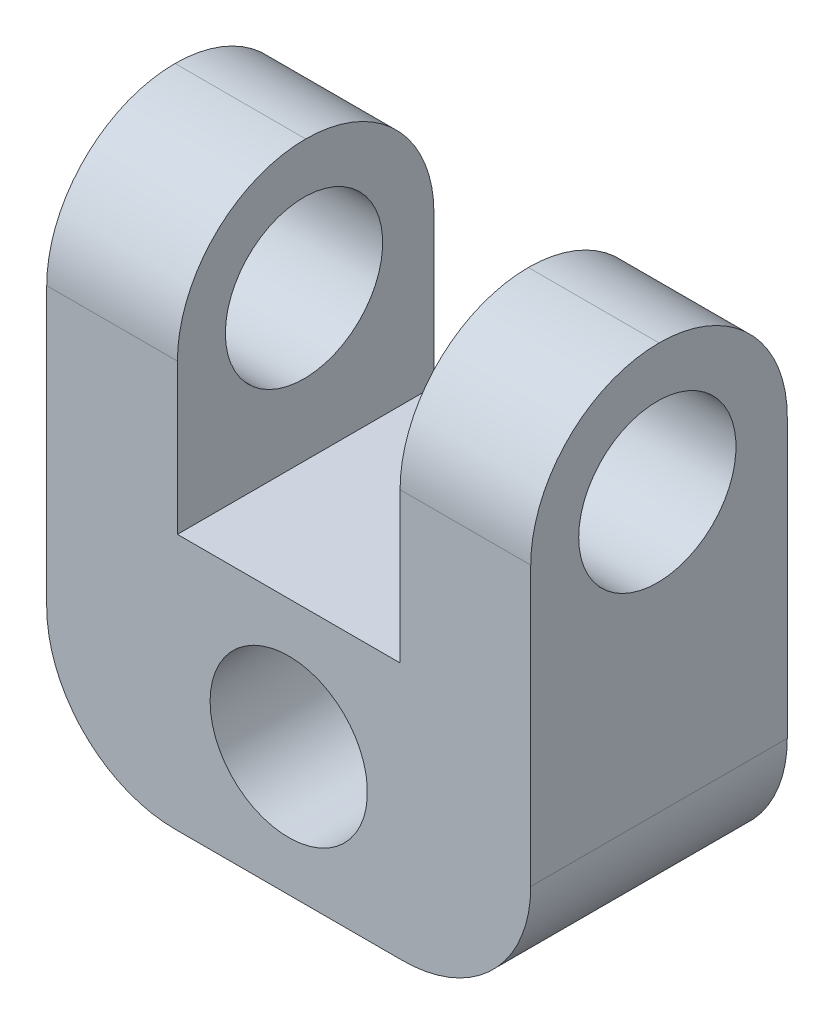
ISO-10303-21;
HEADER;
FILE_DESCRIPTION(('STEP AP214'),'2;1');
FILE_NAME('part.step','',(''),(''),'','','');
FILE_SCHEMA(('AUTOMOTIVE_DESIGN { 1 0 10303 214 1 1 1 1 }'));
ENDSEC;
DATA;
#1=APPLICATION_CONTEXT('core data for automotive mechanical design processes');
#2=APPLICATION_PROTOCOL_DEFINITION('international standard','automotive_design',2000,#1);
#3=PRODUCT_CONTEXT('',#1,'mechanical');
#4=PRODUCT('Part','Part','',(#3));
#5=PRODUCT_RELATED_PRODUCT_CATEGORY('part','',(#4));
#6=PRODUCT_DEFINITION_FORMATION('','',#4);
#7=PRODUCT_DEFINITION_CONTEXT('part definition',#1,'design');
#8=PRODUCT_DEFINITION('design','',#6,#7);
#9=PRODUCT_DEFINITION_SHAPE('','',#8);
#10=(LENGTH_UNIT() NAMED_UNIT(*) SI_UNIT(.MILLI.,.METRE.));
#11=(NAMED_UNIT(*) PLANE_ANGLE_UNIT() SI_UNIT($,.RADIAN.));
#12=(NAMED_UNIT(*) SI_UNIT($,.STERADIAN.) SOLID_ANGLE_UNIT());
#13=UNCERTAINTY_MEASURE_WITH_UNIT(LENGTH_MEASURE(1.E-05),#10,'distance_accuracy_value','');
#14=(GEOMETRIC_REPRESENTATION_CONTEXT(3) GLOBAL_UNCERTAINTY_ASSIGNED_CONTEXT((#13)) GLOBAL_UNIT_ASSIGNED_CONTEXT((#10,
#11,#12)) REPRESENTATION_CONTEXT('',''));
#15=CARTESIAN_POINT('',(0.,0.,0.));
#16=DIRECTION('',(0.,0.,1.));
#17=DIRECTION('',(1.,0.,0.));
#18=AXIS2_PLACEMENT_3D('',#15,#16,#17);
#19=CARTESIAN_POINT('',(-5.,2.65,5.3));
#20=DIRECTION('',(0.,1.,0.));
#21=DIRECTION('',(0.,0.,1.));
#22=AXIS2_PLACEMENT_3D('',#19,#20,#21);
#23=PLANE('',#22);
#24=DIRECTION('',(1.,0.,0.));
#25=VECTOR('',#24,1.);
#26=CARTESIAN_POINT('',(-5.,2.65,0.));
#27=LINE('',#26,#25);
#28=CARTESIAN_POINT('',(-2.3,2.65,0.));
#29=VERTEX_POINT('',#28);
#30=CARTESIAN_POINT('',(2.3,2.65,0.));
#31=VERTEX_POINT('',#30);
#32=EDGE_CURVE('E145',#29,#31,#27,.T.);
#33=ORIENTED_EDGE('',*,*,#32,.F.);
#34=DIRECTION('',(0.,0.,-1.));
#35=VECTOR('',#34,1.);
#36=CARTESIAN_POINT('',(-2.3,2.65,0.));
#37=LINE('',#36,#35);
#38=CARTESIAN_POINT('',(-2.3,2.65,5.3));
#39=VERTEX_POINT('',#38);
#40=EDGE_CURVE('E129',#39,#29,#37,.T.);
#41=ORIENTED_EDGE('',*,*,#40,.F.);
#42=DIRECTION('',(1.,0.,0.));
#43=VECTOR('',#42,1.);
#44=CARTESIAN_POINT('',(-5.,2.65,5.3));
#45=LINE('',#44,#43);
#46=CARTESIAN_POINT('',(2.3,2.65,5.3));
#47=VERTEX_POINT('',#46);
#48=EDGE_CURVE('E142',#39,#47,#45,.T.);
#49=ORIENTED_EDGE('',*,*,#48,.T.);
#50=DIRECTION('',(0.,0.,1.));
#51=VECTOR('',#50,1.);
#52=CARTESIAN_POINT('',(2.3,2.65,0.));
#53=LINE('',#52,#51);
#54=EDGE_CURVE('E136',#31,#47,#53,.T.);
#55=ORIENTED_EDGE('',*,*,#54,.F.);
#56=EDGE_LOOP('',(#33,#41,#49,#55));
#57=FACE_BOUND('',#56,.T.);
#58=ADVANCED_FACE('F34',(#57),#23,.T.);
#59=CARTESIAN_POINT('',(-5.,-2.65,5.3));
#60=DIRECTION('',(-1.,0.,0.));
#61=DIRECTION('',(0.,0.,1.));
#62=AXIS2_PLACEMENT_3D('',#59,#60,#61);
#63=PLANE('',#62);
#64=CARTESIAN_POINT('',(-5.,5.75,2.68435821104784));
#65=DIRECTION('',(-1.,0.,0.));
#66=DIRECTION('',(0.,0.,1.));
#67=AXIS2_PLACEMENT_3D('',#64,#65,#66);
#68=CIRCLE('',#67,1.625);
#69=CARTESIAN_POINT('',(-5.,5.75,4.30935821104784));
#70=VERTEX_POINT('',#69);
#71=EDGE_CURVE('E205',#70,#70,#68,.T.);
#72=ORIENTED_EDGE('',*,*,#71,.F.);
#73=EDGE_LOOP('',(#72));
#74=FACE_BOUND('',#73,.T.);
#75=DIRECTION('',(0.,1.,0.));
#76=VECTOR('',#75,1.);
#77=CARTESIAN_POINT('',(-5.,-2.65,0.));
#78=LINE('',#77,#76);
#79=CARTESIAN_POINT('',(-5.,0.,0.));
#80=VERTEX_POINT('',#79);
#81=CARTESIAN_POINT('',(-5.,5.75,0.));
#82=VERTEX_POINT('',#81);
#83=EDGE_CURVE('E152',#80,#82,#78,.T.);
#84=ORIENTED_EDGE('',*,*,#83,.F.);
#85=DIRECTION('',(0.,0.,-1.));
#86=VECTOR('',#85,1.);
#87=CARTESIAN_POINT('',(-5.,0.,5.3));
#88=LINE('',#87,#86);
#89=CARTESIAN_POINT('',(-5.,0.,5.3));
#90=VERTEX_POINT('',#89);
#91=EDGE_CURVE('E57',#80,#90,#88,.F.);
#92=ORIENTED_EDGE('',*,*,#91,.T.);
#93=DIRECTION('',(0.,1.,0.));
#94=VECTOR('',#93,1.);
#95=CARTESIAN_POINT('',(-5.,-2.65,5.3));
#96=LINE('',#95,#94);
#97=CARTESIAN_POINT('',(-5.,5.75,5.3));
#98=VERTEX_POINT('',#97);
#99=EDGE_CURVE('E163',#90,#98,#96,.T.);
#100=ORIENTED_EDGE('',*,*,#99,.T.);
#101=CARTESIAN_POINT('',(-5.,5.75,2.65));
#102=DIRECTION('',(-1.,0.,0.));
#103=DIRECTION('',(0.,0.,1.));
#104=AXIS2_PLACEMENT_3D('',#101,#102,#103);
#105=CIRCLE('',#104,2.65);
#106=CARTESIAN_POINT('',(-5.,8.4,2.65));
#107=VERTEX_POINT('',#106);
#108=EDGE_CURVE('E199',#98,#107,#105,.T.);
#109=ORIENTED_EDGE('',*,*,#108,.T.);
#110=CARTESIAN_POINT('',(-5.,5.75,2.65));
#111=DIRECTION('',(-1.,0.,0.));
#112=DIRECTION('',(0.,0.,1.));
#113=AXIS2_PLACEMENT_3D('',#110,#111,#112);
#114=CIRCLE('',#113,2.65);
#115=EDGE_CURVE('E196',#107,#82,#114,.T.);
#116=ORIENTED_EDGE('',*,*,#115,.T.);
#117=EDGE_LOOP('',(#84,#92,#100,#109,#116));
#118=FACE_BOUND('',#117,.T.);
#119=ADVANCED_FACE('F229',(#74,#118),#63,.T.);
#120=CARTESIAN_POINT('',(-5.,-2.65,5.3));
#121=DIRECTION('',(0.,1.,0.));
#122=DIRECTION('',(0.,0.,1.));
#123=AXIS2_PLACEMENT_3D('',#120,#121,#122);
#124=PLANE('',#123);
#125=DIRECTION('',(1.,0.,0.));
#126=VECTOR('',#125,1.);
#127=CARTESIAN_POINT('',(-5.,-2.65,5.3));
#128=LINE('',#127,#126);
#129=CARTESIAN_POINT('',(-2.35,-2.65,5.3));
#130=VERTEX_POINT('',#129);
#131=CARTESIAN_POINT('',(2.35,-2.65,5.3));
#132=VERTEX_POINT('',#131);
#133=EDGE_CURVE('E154',#130,#132,#128,.T.);
#134=ORIENTED_EDGE('',*,*,#133,.F.);
#135=DIRECTION('',(0.,0.,-1.));
#136=VECTOR('',#135,1.);
#137=CARTESIAN_POINT('',(-2.35,-2.65,0.));
#138=LINE('',#137,#136);
#139=CARTESIAN_POINT('',(-2.35,-2.65,0.));
#140=VERTEX_POINT('',#139);
#141=EDGE_CURVE('E210',#130,#140,#138,.T.);
#142=ORIENTED_EDGE('',*,*,#141,.T.);
#143=DIRECTION('',(1.,0.,0.));
#144=VECTOR('',#143,1.);
#145=CARTESIAN_POINT('',(-5.,-2.65,0.));
#146=LINE('',#145,#144);
#147=CARTESIAN_POINT('',(2.35,-2.65,0.));
#148=VERTEX_POINT('',#147);
#149=EDGE_CURVE('E156',#140,#148,#146,.T.);
#150=ORIENTED_EDGE('',*,*,#149,.T.);
#151=DIRECTION('',(0.,0.,-1.));
#152=VECTOR('',#151,1.);
#153=CARTESIAN_POINT('',(2.35,-2.65,5.3));
#154=LINE('',#153,#152);
#155=EDGE_CURVE('E201',#148,#132,#154,.F.);
#156=ORIENTED_EDGE('',*,*,#155,.T.);
#157=EDGE_LOOP('',(#134,#142,#150,#156));
#158=FACE_BOUND('',#157,.T.);
#159=ADVANCED_FACE('F223',(#158),#124,.F.);
#160=CARTESIAN_POINT('',(5.,-2.65,5.3));
#161=DIRECTION('',(-1.,0.,0.));
#162=DIRECTION('',(0.,0.,1.));
#163=AXIS2_PLACEMENT_3D('',#160,#161,#162);
#164=PLANE('',#163);
#165=CARTESIAN_POINT('',(5.,5.75,2.68435821104784));
#166=DIRECTION('',(-1.,0.,0.));
#167=DIRECTION('',(0.,0.,1.));
#168=AXIS2_PLACEMENT_3D('',#165,#166,#167);
#169=CIRCLE('',#168,1.625);
#170=CARTESIAN_POINT('',(5.,5.75,4.30935821104784));
#171=VERTEX_POINT('',#170);
#172=EDGE_CURVE('E175',#171,#171,#169,.T.);
#173=ORIENTED_EDGE('',*,*,#172,.T.);
#174=EDGE_LOOP('',(#173));
#175=FACE_BOUND('',#174,.T.);
#176=DIRECTION('',(0.,1.,0.));
#177=VECTOR('',#176,1.);
#178=CARTESIAN_POINT('',(5.,-2.65,5.3));
#179=LINE('',#178,#177);
#180=CARTESIAN_POINT('',(5.,0.,5.3));
#181=VERTEX_POINT('',#180);
#182=CARTESIAN_POINT('',(5.,5.75,5.3));
#183=VERTEX_POINT('',#182);
#184=EDGE_CURVE('E151',#181,#183,#179,.T.);
#185=ORIENTED_EDGE('',*,*,#184,.F.);
#186=DIRECTION('',(0.,0.,-1.));
#187=VECTOR('',#186,1.);
#188=CARTESIAN_POINT('',(5.,0.,5.3));
#189=LINE('',#188,#187);
#190=CARTESIAN_POINT('',(5.,0.,0.));
#191=VERTEX_POINT('',#190);
#192=EDGE_CURVE('E11',#181,#191,#189,.T.);
#193=ORIENTED_EDGE('',*,*,#192,.T.);
#194=DIRECTION('',(0.,1.,0.));
#195=VECTOR('',#194,1.);
#196=CARTESIAN_POINT('',(5.,-2.65,0.));
#197=LINE('',#196,#195);
#198=CARTESIAN_POINT('',(5.,5.75,0.));
#199=VERTEX_POINT('',#198);
#200=EDGE_CURVE('E167',#191,#199,#197,.T.);
#201=ORIENTED_EDGE('',*,*,#200,.T.);
#202=CARTESIAN_POINT('',(5.,5.75,2.65));
#203=DIRECTION('',(-1.,0.,0.));
#204=DIRECTION('',(0.,0.,1.));
#205=AXIS2_PLACEMENT_3D('',#202,#203,#204);
#206=CIRCLE('',#205,2.65);
#207=CARTESIAN_POINT('',(5.,8.4,2.65));
#208=VERTEX_POINT('',#207);
#209=EDGE_CURVE('E187',#199,#208,#206,.F.);
#210=ORIENTED_EDGE('',*,*,#209,.T.);
#211=CARTESIAN_POINT('',(5.,5.75,2.65));
#212=DIRECTION('',(-1.,0.,0.));
#213=DIRECTION('',(0.,0.,1.));
#214=AXIS2_PLACEMENT_3D('',#211,#212,#213);
#215=CIRCLE('',#214,2.65);
#216=EDGE_CURVE('E184',#208,#183,#215,.F.);
#217=ORIENTED_EDGE('',*,*,#216,.T.);
#218=EDGE_LOOP('',(#185,#193,#201,#210,#217));
#219=FACE_BOUND('',#218,.T.);
#220=ADVANCED_FACE('F260',(#175,#219),#164,.F.);
#221=CARTESIAN_POINT('',(0.,0.,5.3));
#222=DIRECTION('',(0.,0.,1.));
#223=DIRECTION('',(1.,0.,0.));
#224=AXIS2_PLACEMENT_3D('',#221,#222,#223);
#225=PLANE('',#224);
#226=CARTESIAN_POINT('',(0.,0.,5.3));
#227=DIRECTION('',(0.,0.,-1.));
#228=DIRECTION('',(-1.,0.,0.));
#229=AXIS2_PLACEMENT_3D('',#226,#227,#228);
#230=CIRCLE('',#229,1.625);
#231=CARTESIAN_POINT('',(-1.625,0.,5.3));
#232=VERTEX_POINT('',#231);
#233=EDGE_CURVE('E168',#232,#232,#230,.T.);
#234=ORIENTED_EDGE('',*,*,#233,.T.);
#235=EDGE_LOOP('',(#234));
#236=FACE_BOUND('',#235,.T.);
#237=ORIENTED_EDGE('',*,*,#99,.F.);
#238=CARTESIAN_POINT('',(-2.35,0.,5.3));
#239=DIRECTION('',(0.,0.,1.));
#240=DIRECTION('',(1.,0.,0.));
#241=AXIS2_PLACEMENT_3D('',#238,#239,#240);
#242=CIRCLE('',#241,2.65);
#243=EDGE_CURVE('E42',#90,#130,#242,.T.);
#244=ORIENTED_EDGE('',*,*,#243,.T.);
#245=ORIENTED_EDGE('',*,*,#133,.T.);
#246=CARTESIAN_POINT('',(2.35,0.,5.3));
#247=DIRECTION('',(0.,0.,1.));
#248=DIRECTION('',(1.,0.,0.));
#249=AXIS2_PLACEMENT_3D('',#246,#247,#248);
#250=CIRCLE('',#249,2.65);
#251=EDGE_CURVE('E49',#132,#181,#250,.T.);
#252=ORIENTED_EDGE('',*,*,#251,.T.);
#253=ORIENTED_EDGE('',*,*,#184,.T.);
#254=DIRECTION('',(1.,0.,0.));
#255=VECTOR('',#254,1.);
#256=CARTESIAN_POINT('',(0.,5.75,5.3));
#257=LINE('',#256,#255);
#258=CARTESIAN_POINT('',(2.3,5.75,5.3));
#259=VERTEX_POINT('',#258);
#260=EDGE_CURVE('E191',#183,#259,#257,.F.);
#261=ORIENTED_EDGE('',*,*,#260,.T.);
#262=DIRECTION('',(0.,-1.,0.));
#263=VECTOR('',#262,1.);
#264=CARTESIAN_POINT('',(2.3,8.4,5.3));
#265=LINE('',#264,#263);
#266=EDGE_CURVE('E150',#259,#47,#265,.T.);
#267=ORIENTED_EDGE('',*,*,#266,.T.);
#268=ORIENTED_EDGE('',*,*,#48,.F.);
#269=DIRECTION('',(0.,-1.,0.));
#270=VECTOR('',#269,1.);
#271=CARTESIAN_POINT('',(-2.3,8.4,5.3));
#272=LINE('',#271,#270);
#273=CARTESIAN_POINT('',(-2.3,5.75,5.3));
#274=VERTEX_POINT('',#273);
#275=EDGE_CURVE('E125',#274,#39,#272,.T.);
#276=ORIENTED_EDGE('',*,*,#275,.F.);
#277=DIRECTION('',(1.,0.,0.));
#278=VECTOR('',#277,1.);
#279=CARTESIAN_POINT('',(0.,5.75,5.3));
#280=LINE('',#279,#278);
#281=EDGE_CURVE('E189',#274,#98,#280,.F.);
#282=ORIENTED_EDGE('',*,*,#281,.T.);
#283=EDGE_LOOP('',(#237,#244,#245,#252,#253,#261,#267,#268,#276,#282));
#284=FACE_BOUND('',#283,.T.);
#285=ADVANCED_FACE('F148',(#236,#284),#225,.T.);
#286=CARTESIAN_POINT('',(0.,0.,0.));
#287=DIRECTION('',(0.,0.,1.));
#288=DIRECTION('',(1.,0.,0.));
#289=AXIS2_PLACEMENT_3D('',#286,#287,#288);
#290=PLANE('',#289);
#291=CARTESIAN_POINT('',(0.,0.,0.));
#292=DIRECTION('',(0.,0.,-1.));
#293=DIRECTION('',(-1.,0.,0.));
#294=AXIS2_PLACEMENT_3D('',#291,#292,#293);
#295=CIRCLE('',#294,1.625);
#296=CARTESIAN_POINT('',(-1.625,0.,0.));
#297=VERTEX_POINT('',#296);
#298=EDGE_CURVE('E159',#297,#297,#295,.T.);
#299=ORIENTED_EDGE('',*,*,#298,.F.);
#300=EDGE_LOOP('',(#299));
#301=FACE_BOUND('',#300,.T.);
#302=ORIENTED_EDGE('',*,*,#149,.F.);
#303=CARTESIAN_POINT('',(-2.35,0.,0.));
#304=DIRECTION('',(0.,0.,1.));
#305=DIRECTION('',(1.,0.,0.));
#306=AXIS2_PLACEMENT_3D('',#303,#304,#305);
#307=CIRCLE('',#306,2.65);
#308=EDGE_CURVE('E215',#140,#80,#307,.F.);
#309=ORIENTED_EDGE('',*,*,#308,.T.);
#310=ORIENTED_EDGE('',*,*,#83,.T.);
#311=DIRECTION('',(-1.,0.,0.));
#312=VECTOR('',#311,1.);
#313=CARTESIAN_POINT('',(-2.3,5.75,0.));
#314=LINE('',#313,#312);
#315=CARTESIAN_POINT('',(-2.3,5.75,0.));
#316=VERTEX_POINT('',#315);
#317=EDGE_CURVE('E179',#82,#316,#314,.F.);
#318=ORIENTED_EDGE('',*,*,#317,.T.);
#319=DIRECTION('',(0.,-1.,0.));
#320=VECTOR('',#319,1.);
#321=CARTESIAN_POINT('',(-2.3,8.4,0.));
#322=LINE('',#321,#320);
#323=EDGE_CURVE('E137',#316,#29,#322,.T.);
#324=ORIENTED_EDGE('',*,*,#323,.T.);
#325=ORIENTED_EDGE('',*,*,#32,.T.);
#326=DIRECTION('',(0.,-1.,0.));
#327=VECTOR('',#326,1.);
#328=CARTESIAN_POINT('',(2.3,8.4,0.));
#329=LINE('',#328,#327);
#330=CARTESIAN_POINT('',(2.3,5.75,0.));
#331=VERTEX_POINT('',#330);
#332=EDGE_CURVE('E241',#331,#31,#329,.T.);
#333=ORIENTED_EDGE('',*,*,#332,.F.);
#334=DIRECTION('',(-1.,0.,0.));
#335=VECTOR('',#334,1.);
#336=CARTESIAN_POINT('',(5.,5.75,0.));
#337=LINE('',#336,#335);
#338=EDGE_CURVE('E181',#331,#199,#337,.F.);
#339=ORIENTED_EDGE('',*,*,#338,.T.);
#340=ORIENTED_EDGE('',*,*,#200,.F.);
#341=CARTESIAN_POINT('',(2.35,0.,0.));
#342=DIRECTION('',(0.,0.,1.));
#343=DIRECTION('',(1.,0.,0.));
#344=AXIS2_PLACEMENT_3D('',#341,#342,#343);
#345=CIRCLE('',#344,2.65);
#346=EDGE_CURVE('E213',#191,#148,#345,.F.);
#347=ORIENTED_EDGE('',*,*,#346,.T.);
#348=EDGE_LOOP('',(#302,#309,#310,#318,#324,#325,#333,#339,#340,#347));
#349=FACE_BOUND('',#348,.T.);
#350=ADVANCED_FACE('F228',(#301,#349),#290,.F.);
#351=CARTESIAN_POINT('',(0.,0.,5.3));
#352=DIRECTION('',(0.,0.,-1.));
#353=DIRECTION('',(-1.,0.,0.));
#354=AXIS2_PLACEMENT_3D('',#351,#352,#353);
#355=CYLINDRICAL_SURFACE('',#354,1.625);
#356=ORIENTED_EDGE('',*,*,#233,.F.);
#357=EDGE_LOOP('',(#356));
#358=FACE_BOUND('',#357,.T.);
#359=ORIENTED_EDGE('',*,*,#298,.T.);
#360=EDGE_LOOP('',(#359));
#361=FACE_BOUND('',#360,.T.);
#362=ADVANCED_FACE('F249',(#358,#361),#355,.F.);
#363=CARTESIAN_POINT('',(2.3,8.4,0.));
#364=DIRECTION('',(1.,0.,0.));
#365=DIRECTION('',(0.,0.,-1.));
#366=AXIS2_PLACEMENT_3D('',#363,#364,#365);
#367=PLANE('',#366);
#368=CARTESIAN_POINT('',(2.3,5.75,2.68435821104784));
#369=DIRECTION('',(1.,0.,0.));
#370=DIRECTION('',(0.,0.,-1.));
#371=AXIS2_PLACEMENT_3D('',#368,#369,#370);
#372=CIRCLE('',#371,1.625);
#373=CARTESIAN_POINT('',(2.3,5.75,1.05935821104784));
#374=VERTEX_POINT('',#373);
#375=EDGE_CURVE('E146',#374,#374,#372,.T.);
#376=ORIENTED_EDGE('',*,*,#375,.T.);
#377=EDGE_LOOP('',(#376));
#378=FACE_BOUND('',#377,.T.);
#379=CARTESIAN_POINT('',(2.3,5.75,2.65));
#380=DIRECTION('',(1.,0.,0.));
#381=DIRECTION('',(0.,0.,-1.));
#382=AXIS2_PLACEMENT_3D('',#379,#380,#381);
#383=CIRCLE('',#382,2.65);
#384=CARTESIAN_POINT('',(2.3,8.4,2.65));
#385=VERTEX_POINT('',#384);
#386=EDGE_CURVE('E165',#259,#385,#383,.F.);
#387=ORIENTED_EDGE('',*,*,#386,.T.);
#388=CARTESIAN_POINT('',(2.3,5.75,2.65));
#389=DIRECTION('',(1.,0.,0.));
#390=DIRECTION('',(0.,0.,-1.));
#391=AXIS2_PLACEMENT_3D('',#388,#389,#390);
#392=CIRCLE('',#391,2.65);
#393=EDGE_CURVE('E177',#385,#331,#392,.F.);
#394=ORIENTED_EDGE('',*,*,#393,.T.);
#395=ORIENTED_EDGE('',*,*,#332,.T.);
#396=ORIENTED_EDGE('',*,*,#54,.T.);
#397=ORIENTED_EDGE('',*,*,#266,.F.);
#398=EDGE_LOOP('',(#387,#394,#395,#396,#397));
#399=FACE_BOUND('',#398,.T.);
#400=ADVANCED_FACE('F257',(#378,#399),#367,.F.);
#401=CARTESIAN_POINT('',(-2.3,8.4,0.));
#402=DIRECTION('',(-1.,0.,0.));
#403=DIRECTION('',(0.,0.,1.));
#404=AXIS2_PLACEMENT_3D('',#401,#402,#403);
#405=PLANE('',#404);
#406=CARTESIAN_POINT('',(-2.3,5.75,2.68435821104784));
#407=DIRECTION('',(-1.,0.,0.));
#408=DIRECTION('',(0.,0.,1.));
#409=AXIS2_PLACEMENT_3D('',#406,#407,#408);
#410=CIRCLE('',#409,1.625);
#411=CARTESIAN_POINT('',(-2.3,5.75,4.30935821104784));
#412=VERTEX_POINT('',#411);
#413=EDGE_CURVE('E172',#412,#412,#410,.T.);
#414=ORIENTED_EDGE('',*,*,#413,.T.);
#415=EDGE_LOOP('',(#414));
#416=FACE_BOUND('',#415,.T.);
#417=CARTESIAN_POINT('',(-2.3,5.75,2.65));
#418=DIRECTION('',(-1.,0.,0.));
#419=DIRECTION('',(0.,0.,1.));
#420=AXIS2_PLACEMENT_3D('',#417,#418,#419);
#421=CIRCLE('',#420,2.65);
#422=CARTESIAN_POINT('',(-2.3,8.4,2.65));
#423=VERTEX_POINT('',#422);
#424=EDGE_CURVE('E193',#316,#423,#421,.F.);
#425=ORIENTED_EDGE('',*,*,#424,.T.);
#426=CARTESIAN_POINT('',(-2.3,5.75,2.65));
#427=DIRECTION('',(-1.,0.,0.));
#428=DIRECTION('',(0.,0.,1.));
#429=AXIS2_PLACEMENT_3D('',#426,#427,#428);
#430=CIRCLE('',#429,2.65);
#431=EDGE_CURVE('E132',#423,#274,#430,.F.);
#432=ORIENTED_EDGE('',*,*,#431,.T.);
#433=ORIENTED_EDGE('',*,*,#275,.T.);
#434=ORIENTED_EDGE('',*,*,#40,.T.);
#435=ORIENTED_EDGE('',*,*,#323,.F.);
#436=EDGE_LOOP('',(#425,#432,#433,#434,#435));
#437=FACE_BOUND('',#436,.T.);
#438=ADVANCED_FACE('F127',(#416,#437),#405,.F.);
#439=CARTESIAN_POINT('',(5.,5.75,2.68435821104784));
#440=DIRECTION('',(-1.,0.,0.));
#441=DIRECTION('',(0.,0.,1.));
#442=AXIS2_PLACEMENT_3D('',#439,#440,#441);
#443=CYLINDRICAL_SURFACE('',#442,1.625);
#444=ORIENTED_EDGE('',*,*,#71,.T.);
#445=EDGE_LOOP('',(#444));
#446=FACE_BOUND('',#445,.T.);
#447=ORIENTED_EDGE('',*,*,#413,.F.);
#448=EDGE_LOOP('',(#447));
#449=FACE_BOUND('',#448,.T.);
#450=ADVANCED_FACE('F311',(#446,#449),#443,.F.);
#451=ORIENTED_EDGE('',*,*,#172,.F.);
#452=EDGE_LOOP('',(#451));
#453=FACE_BOUND('',#452,.T.);
#454=ORIENTED_EDGE('',*,*,#375,.F.);
#455=EDGE_LOOP('',(#454));
#456=FACE_BOUND('',#455,.T.);
#457=ADVANCED_FACE('F279',(#453,#456),#443,.F.);
#458=CARTESIAN_POINT('',(0.,5.75,2.65));
#459=DIRECTION('',(1.,0.,0.));
#460=DIRECTION('',(0.,0.,-1.));
#461=AXIS2_PLACEMENT_3D('',#458,#459,#460);
#462=CYLINDRICAL_SURFACE('',#461,2.65);
#463=ORIENTED_EDGE('',*,*,#260,.F.);
#464=ORIENTED_EDGE('',*,*,#216,.F.);
#465=DIRECTION('',(1.,0.,0.));
#466=VECTOR('',#465,1.);
#467=CARTESIAN_POINT('',(0.,8.4,2.65));
#468=LINE('',#467,#466);
#469=EDGE_CURVE('E202',#385,#208,#468,.T.);
#470=ORIENTED_EDGE('',*,*,#469,.F.);
#471=ORIENTED_EDGE('',*,*,#386,.F.);
#472=EDGE_LOOP('',(#463,#464,#470,#471));
#473=FACE_BOUND('',#472,.T.);
#474=ADVANCED_FACE('F275',(#473),#462,.T.);
#475=CARTESIAN_POINT('',(0.,5.75,2.65));
#476=DIRECTION('',(1.,0.,0.));
#477=DIRECTION('',(0.,0.,-1.));
#478=AXIS2_PLACEMENT_3D('',#475,#476,#477);
#479=CYLINDRICAL_SURFACE('',#478,2.65);
#480=ORIENTED_EDGE('',*,*,#209,.F.);
#481=ORIENTED_EDGE('',*,*,#338,.F.);
#482=ORIENTED_EDGE('',*,*,#393,.F.);
#483=ORIENTED_EDGE('',*,*,#469,.T.);
#484=EDGE_LOOP('',(#480,#481,#482,#483));
#485=FACE_BOUND('',#484,.T.);
#486=ADVANCED_FACE('F272',(#485),#479,.T.);
#487=CARTESIAN_POINT('',(0.,5.75,2.65));
#488=DIRECTION('',(1.,0.,0.));
#489=DIRECTION('',(0.,0.,-1.));
#490=AXIS2_PLACEMENT_3D('',#487,#488,#489);
#491=CYLINDRICAL_SURFACE('',#490,2.65);
#492=ORIENTED_EDGE('',*,*,#317,.F.);
#493=ORIENTED_EDGE('',*,*,#115,.F.);
#494=DIRECTION('',(-1.,0.,0.));
#495=VECTOR('',#494,1.);
#496=CARTESIAN_POINT('',(-5.,8.4,2.65));
#497=LINE('',#496,#495);
#498=EDGE_CURVE('E206',#423,#107,#497,.T.);
#499=ORIENTED_EDGE('',*,*,#498,.F.);
#500=ORIENTED_EDGE('',*,*,#424,.F.);
#501=EDGE_LOOP('',(#492,#493,#499,#500));
#502=FACE_BOUND('',#501,.T.);
#503=ADVANCED_FACE('F236',(#502),#491,.T.);
#504=CARTESIAN_POINT('',(0.,5.75,2.65));
#505=DIRECTION('',(1.,0.,0.));
#506=DIRECTION('',(0.,0.,-1.));
#507=AXIS2_PLACEMENT_3D('',#504,#505,#506);
#508=CYLINDRICAL_SURFACE('',#507,2.65);
#509=ORIENTED_EDGE('',*,*,#108,.F.);
#510=ORIENTED_EDGE('',*,*,#281,.F.);
#511=ORIENTED_EDGE('',*,*,#431,.F.);
#512=ORIENTED_EDGE('',*,*,#498,.T.);
#513=EDGE_LOOP('',(#509,#510,#511,#512));
#514=FACE_BOUND('',#513,.T.);
#515=ADVANCED_FACE('F281',(#514),#508,.T.);
#516=CARTESIAN_POINT('',(-2.35,0.,5.3));
#517=DIRECTION('',(0.,0.,1.));
#518=DIRECTION('',(1.,0.,0.));
#519=AXIS2_PLACEMENT_3D('',#516,#517,#518);
#520=CYLINDRICAL_SURFACE('',#519,2.65);
#521=ORIENTED_EDGE('',*,*,#243,.F.);
#522=ORIENTED_EDGE('',*,*,#91,.F.);
#523=ORIENTED_EDGE('',*,*,#308,.F.);
#524=ORIENTED_EDGE('',*,*,#141,.F.);
#525=EDGE_LOOP('',(#521,#522,#523,#524));
#526=FACE_BOUND('',#525,.T.);
#527=ADVANCED_FACE('F226',(#526),#520,.T.);
#528=CARTESIAN_POINT('',(2.35,0.,5.3));
#529=DIRECTION('',(0.,0.,-1.));
#530=DIRECTION('',(-1.,0.,0.));
#531=AXIS2_PLACEMENT_3D('',#528,#529,#530);
#532=CYLINDRICAL_SURFACE('',#531,2.65);
#533=ORIENTED_EDGE('',*,*,#251,.F.);
#534=ORIENTED_EDGE('',*,*,#155,.F.);
#535=ORIENTED_EDGE('',*,*,#346,.F.);
#536=ORIENTED_EDGE('',*,*,#192,.F.);
#537=EDGE_LOOP('',(#533,#534,#535,#536));
#538=FACE_BOUND('',#537,.T.);
#539=ADVANCED_FACE('F36',(#538),#532,.T.);
#540=CLOSED_SHELL('',(#58,#119,#159,#220,#285,#350,#362,#400,#438,#450,#457,#474,#486,#503,#515,
#527,#539));
#541=MANIFOLD_SOLID_BREP('B2',#540);
#542=ADVANCED_BREP_SHAPE_REPRESENTATION('',(#18,#541),#14);
#543=SHAPE_DEFINITION_REPRESENTATION(#9,#542);
ENDSEC;
END-ISO-10303-21;
